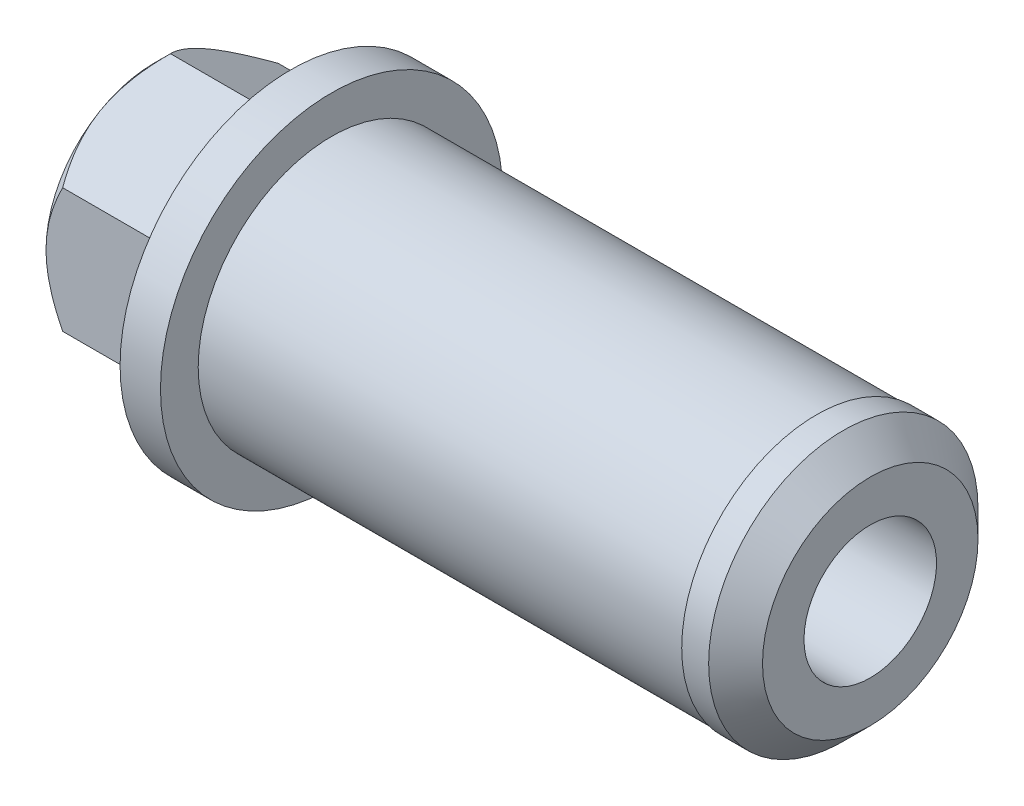
ISO-10303-21;
HEADER;
FILE_DESCRIPTION(('STEP AP214'),'2;1');
FILE_NAME('part.step','',(''),(''),'','','');
FILE_SCHEMA(('AUTOMOTIVE_DESIGN { 1 0 10303 214 1 1 1 1 }'));
ENDSEC;
DATA;
#1=APPLICATION_CONTEXT('core data for automotive mechanical design processes');
#2=APPLICATION_PROTOCOL_DEFINITION('international standard','automotive_design',2000,#1);
#3=PRODUCT_CONTEXT('',#1,'mechanical');
#4=PRODUCT('Part','Part','',(#3));
#5=PRODUCT_RELATED_PRODUCT_CATEGORY('part','',(#4));
#6=PRODUCT_DEFINITION_FORMATION('','',#4);
#7=PRODUCT_DEFINITION_CONTEXT('part definition',#1,'design');
#8=PRODUCT_DEFINITION('design','',#6,#7);
#9=PRODUCT_DEFINITION_SHAPE('','',#8);
#10=(LENGTH_UNIT() NAMED_UNIT(*) SI_UNIT(.MILLI.,.METRE.));
#11=(NAMED_UNIT(*) PLANE_ANGLE_UNIT() SI_UNIT($,.RADIAN.));
#12=(NAMED_UNIT(*) SI_UNIT($,.STERADIAN.) SOLID_ANGLE_UNIT());
#13=UNCERTAINTY_MEASURE_WITH_UNIT(LENGTH_MEASURE(1.E-05),#10,'distance_accuracy_value','');
#14=(GEOMETRIC_REPRESENTATION_CONTEXT(3) GLOBAL_UNCERTAINTY_ASSIGNED_CONTEXT((#13)) GLOBAL_UNIT_ASSIGNED_CONTEXT((#10,
#11,#12)) REPRESENTATION_CONTEXT('',''));
#15=CARTESIAN_POINT('',(0.,0.,0.));
#16=DIRECTION('',(0.,0.,1.));
#17=DIRECTION('',(1.,0.,0.));
#18=AXIS2_PLACEMENT_3D('',#15,#16,#17);
#19=CARTESIAN_POINT('',(-5.1,0.,0.));
#20=DIRECTION('',(-1.,0.,0.));
#21=DIRECTION('',(0.,0.,1.));
#22=AXIS2_PLACEMENT_3D('',#19,#20,#21);
#23=PLANE('',#22);
#24=CARTESIAN_POINT('',(-5.1,0.,0.));
#25=DIRECTION('',(-1.,0.,0.));
#26=DIRECTION('',(0.,0.,1.));
#27=AXIS2_PLACEMENT_3D('',#24,#25,#26);
#28=CIRCLE('',#27,2.96);
#29=CARTESIAN_POINT('',(-5.1,0.,2.96));
#30=VERTEX_POINT('',#29);
#31=EDGE_CURVE('E11',#30,#30,#28,.F.);
#32=ORIENTED_EDGE('',*,*,#31,.T.);
#33=EDGE_LOOP('',(#32));
#34=FACE_BOUND('',#33,.T.);
#35=CARTESIAN_POINT('',(-5.1,0.,0.));
#36=DIRECTION('',(1.,0.,0.));
#37=DIRECTION('',(0.,0.,-1.));
#38=AXIS2_PLACEMENT_3D('',#35,#36,#37);
#39=CIRCLE('',#38,4.);
#40=CARTESIAN_POINT('',(-5.1,0.,4.));
#41=VERTEX_POINT('',#40);
#42=CARTESIAN_POINT('',(-5.1,-3.46410161513775,2.));
#43=VERTEX_POINT('',#42);
#44=EDGE_CURVE('E282',#41,#43,#39,.T.);
#45=ORIENTED_EDGE('',*,*,#44,.F.);
#46=CARTESIAN_POINT('',(-5.1,3.46410161513776,2.));
#47=VERTEX_POINT('',#46);
#48=EDGE_CURVE('E51',#47,#41,#39,.T.);
#49=ORIENTED_EDGE('',*,*,#48,.F.);
#50=CARTESIAN_POINT('',(-5.1,3.46410161513775,-2.));
#51=VERTEX_POINT('',#50);
#52=EDGE_CURVE('E287',#51,#47,#39,.T.);
#53=ORIENTED_EDGE('',*,*,#52,.F.);
#54=CARTESIAN_POINT('',(-5.1,0.,-4.));
#55=VERTEX_POINT('',#54);
#56=EDGE_CURVE('E59',#55,#51,#39,.T.);
#57=ORIENTED_EDGE('',*,*,#56,.F.);
#58=CARTESIAN_POINT('',(-5.1,-3.46410161513776,-2.));
#59=VERTEX_POINT('',#58);
#60=EDGE_CURVE('E288',#59,#55,#39,.T.);
#61=ORIENTED_EDGE('',*,*,#60,.F.);
#62=EDGE_CURVE('E284',#43,#59,#39,.T.);
#63=ORIENTED_EDGE('',*,*,#62,.F.);
#64=EDGE_LOOP('',(#45,#49,#53,#57,#61,#63));
#65=FACE_BOUND('',#64,.T.);
#66=ADVANCED_FACE('F36',(#34,#65),#23,.T.);
#67=CARTESIAN_POINT('',(0.,0.,-2.46));
#68=DIRECTION('',(1.,0.,0.));
#69=DIRECTION('',(0.,0.,-1.));
#70=AXIS2_PLACEMENT_3D('',#67,#68,#69);
#71=PLANE('',#70);
#72=CARTESIAN_POINT('',(0.,0.,0.));
#73=DIRECTION('',(-1.,0.,0.));
#74=DIRECTION('',(0.,0.,1.));
#75=AXIS2_PLACEMENT_3D('',#72,#73,#74);
#76=CIRCLE('',#75,6.35);
#77=CARTESIAN_POINT('',(0.,0.,6.35));
#78=VERTEX_POINT('',#77);
#79=EDGE_CURVE('E159',#78,#78,#76,.T.);
#80=ORIENTED_EDGE('',*,*,#79,.T.);
#81=EDGE_LOOP('',(#80));
#82=FACE_BOUND('',#81,.T.);
#83=DIRECTION('',(0.,0.500000000000001,0.866025403784438));
#84=VECTOR('',#83,1.);
#85=CARTESIAN_POINT('',(0.,-4.61880215351701,0.));
#86=LINE('',#85,#84);
#87=CARTESIAN_POINT('',(0.,-4.61880215351701,0.));
#88=VERTEX_POINT('',#87);
#89=CARTESIAN_POINT('',(0.,-2.3094010767585,4.));
#90=VERTEX_POINT('',#89);
#91=EDGE_CURVE('E303',#88,#90,#86,.T.);
#92=ORIENTED_EDGE('',*,*,#91,.F.);
#93=DIRECTION('',(0.,-0.5,0.866025403784438));
#94=VECTOR('',#93,1.);
#95=CARTESIAN_POINT('',(0.,-2.3094010767585,-4.));
#96=LINE('',#95,#94);
#97=CARTESIAN_POINT('',(0.,-2.3094010767585,-4.));
#98=VERTEX_POINT('',#97);
#99=EDGE_CURVE('E314',#98,#88,#96,.T.);
#100=ORIENTED_EDGE('',*,*,#99,.F.);
#101=DIRECTION('',(0.,-1.,0.));
#102=VECTOR('',#101,1.);
#103=CARTESIAN_POINT('',(0.,2.3094010767585,-4.));
#104=LINE('',#103,#102);
#105=CARTESIAN_POINT('',(0.,2.3094010767585,-4.));
#106=VERTEX_POINT('',#105);
#107=EDGE_CURVE('E312',#106,#98,#104,.T.);
#108=ORIENTED_EDGE('',*,*,#107,.F.);
#109=DIRECTION('',(0.,-0.500000000000001,-0.866025403784438));
#110=VECTOR('',#109,1.);
#111=CARTESIAN_POINT('',(0.,4.61880215351701,0.));
#112=LINE('',#111,#110);
#113=CARTESIAN_POINT('',(0.,4.61880215351701,0.));
#114=VERTEX_POINT('',#113);
#115=EDGE_CURVE('E131',#114,#106,#112,.T.);
#116=ORIENTED_EDGE('',*,*,#115,.F.);
#117=DIRECTION('',(0.,0.5,-0.866025403784439));
#118=VECTOR('',#117,1.);
#119=CARTESIAN_POINT('',(0.,2.30940107675851,4.));
#120=LINE('',#119,#118);
#121=CARTESIAN_POINT('',(0.,2.30940107675851,4.));
#122=VERTEX_POINT('',#121);
#123=EDGE_CURVE('E307',#122,#114,#120,.T.);
#124=ORIENTED_EDGE('',*,*,#123,.F.);
#125=DIRECTION('',(0.,1.,0.));
#126=VECTOR('',#125,1.);
#127=CARTESIAN_POINT('',(0.,-2.3094010767585,4.));
#128=LINE('',#127,#126);
#129=EDGE_CURVE('E305',#90,#122,#128,.T.);
#130=ORIENTED_EDGE('',*,*,#129,.F.);
#131=EDGE_LOOP('',(#92,#100,#108,#116,#124,#130));
#132=FACE_BOUND('',#131,.T.);
#133=ADVANCED_FACE('F262',(#82,#132),#71,.F.);
#134=CARTESIAN_POINT('',(0.,0.,0.));
#135=DIRECTION('',(-1.,0.,0.));
#136=DIRECTION('',(0.,0.,1.));
#137=AXIS2_PLACEMENT_3D('',#134,#135,#136);
#138=CYLINDRICAL_SURFACE('',#137,2.46);
#139=CARTESIAN_POINT('',(-4.6,0.,0.));
#140=DIRECTION('',(-1.,0.,0.));
#141=DIRECTION('',(0.,0.,1.));
#142=AXIS2_PLACEMENT_3D('',#139,#140,#141);
#143=CIRCLE('',#142,2.46);
#144=CARTESIAN_POINT('',(-4.6,0.,2.46));
#145=VERTEX_POINT('',#144);
#146=EDGE_CURVE('E44',#145,#145,#143,.T.);
#147=ORIENTED_EDGE('',*,*,#146,.T.);
#148=EDGE_LOOP('',(#147));
#149=FACE_BOUND('',#148,.T.);
#150=CARTESIAN_POINT('',(21.5,0.,0.));
#151=DIRECTION('',(-1.,0.,0.));
#152=DIRECTION('',(0.,0.,1.));
#153=AXIS2_PLACEMENT_3D('',#150,#151,#152);
#154=CIRCLE('',#153,2.46);
#155=CARTESIAN_POINT('',(21.5,0.,2.46));
#156=VERTEX_POINT('',#155);
#157=EDGE_CURVE('E144',#156,#156,#154,.T.);
#158=ORIENTED_EDGE('',*,*,#157,.F.);
#159=EDGE_LOOP('',(#158));
#160=FACE_BOUND('',#159,.T.);
#161=ADVANCED_FACE('F260',(#149,#160),#138,.F.);
#162=CARTESIAN_POINT('',(0.,0.,0.));
#163=DIRECTION('',(-1.,0.,0.));
#164=DIRECTION('',(0.,0.,1.));
#165=AXIS2_PLACEMENT_3D('',#162,#163,#164);
#166=CYLINDRICAL_SURFACE('',#165,6.35);
#167=ORIENTED_EDGE('',*,*,#79,.F.);
#168=EDGE_LOOP('',(#167));
#169=FACE_BOUND('',#168,.T.);
#170=CARTESIAN_POINT('',(1.5,0.,0.));
#171=DIRECTION('',(-1.,0.,0.));
#172=DIRECTION('',(0.,0.,1.));
#173=AXIS2_PLACEMENT_3D('',#170,#171,#172);
#174=CIRCLE('',#173,6.35);
#175=CARTESIAN_POINT('',(1.5,0.,6.35));
#176=VERTEX_POINT('',#175);
#177=EDGE_CURVE('E156',#176,#176,#174,.T.);
#178=ORIENTED_EDGE('',*,*,#177,.T.);
#179=EDGE_LOOP('',(#178));
#180=FACE_BOUND('',#179,.T.);
#181=ADVANCED_FACE('F256',(#169,#180),#166,.T.);
#182=CARTESIAN_POINT('',(1.5,0.,-6.35));
#183=DIRECTION('',(-1.,0.,0.));
#184=DIRECTION('',(0.,0.,1.));
#185=AXIS2_PLACEMENT_3D('',#182,#183,#184);
#186=PLANE('',#185);
#187=ORIENTED_EDGE('',*,*,#177,.F.);
#188=EDGE_LOOP('',(#187));
#189=FACE_BOUND('',#188,.T.);
#190=CARTESIAN_POINT('',(1.5,0.,0.));
#191=DIRECTION('',(-1.,0.,0.));
#192=DIRECTION('',(0.,0.,1.));
#193=AXIS2_PLACEMENT_3D('',#190,#191,#192);
#194=CIRCLE('',#193,4.95);
#195=CARTESIAN_POINT('',(1.5,0.,4.95));
#196=VERTEX_POINT('',#195);
#197=EDGE_CURVE('E153',#196,#196,#194,.T.);
#198=ORIENTED_EDGE('',*,*,#197,.T.);
#199=EDGE_LOOP('',(#198));
#200=FACE_BOUND('',#199,.T.);
#201=ADVANCED_FACE('F252',(#189,#200),#186,.F.);
#202=CARTESIAN_POINT('',(0.,0.,0.));
#203=DIRECTION('',(-1.,0.,0.));
#204=DIRECTION('',(0.,0.,1.));
#205=AXIS2_PLACEMENT_3D('',#202,#203,#204);
#206=CYLINDRICAL_SURFACE('',#205,4.95);
#207=ORIENTED_EDGE('',*,*,#197,.F.);
#208=EDGE_LOOP('',(#207));
#209=FACE_BOUND('',#208,.T.);
#210=CARTESIAN_POINT('',(19.5,0.,0.));
#211=DIRECTION('',(-1.,0.,0.));
#212=DIRECTION('',(0.,0.,1.));
#213=AXIS2_PLACEMENT_3D('',#210,#211,#212);
#214=CIRCLE('',#213,4.95);
#215=CARTESIAN_POINT('',(19.5,0.,4.95));
#216=VERTEX_POINT('',#215);
#217=EDGE_CURVE('E150',#216,#216,#214,.T.);
#218=ORIENTED_EDGE('',*,*,#217,.T.);
#219=EDGE_LOOP('',(#218));
#220=FACE_BOUND('',#219,.T.);
#221=ADVANCED_FACE('F248',(#209,#220),#206,.T.);
#222=CARTESIAN_POINT('',(19.5,0.,-4.95));
#223=DIRECTION('',(1.,0.,0.));
#224=DIRECTION('',(0.,0.,-1.));
#225=AXIS2_PLACEMENT_3D('',#222,#223,#224);
#226=PLANE('',#225);
#227=ORIENTED_EDGE('',*,*,#217,.F.);
#228=EDGE_LOOP('',(#227));
#229=FACE_BOUND('',#228,.T.);
#230=CARTESIAN_POINT('',(19.5,0.,0.));
#231=DIRECTION('',(-1.,0.,0.));
#232=DIRECTION('',(0.,0.,1.));
#233=AXIS2_PLACEMENT_3D('',#230,#231,#232);
#234=CIRCLE('',#233,5.);
#235=CARTESIAN_POINT('',(19.5,0.,5.));
#236=VERTEX_POINT('',#235);
#237=EDGE_CURVE('E147',#236,#236,#234,.T.);
#238=ORIENTED_EDGE('',*,*,#237,.T.);
#239=EDGE_LOOP('',(#238));
#240=FACE_BOUND('',#239,.T.);
#241=ADVANCED_FACE('F244',(#229,#240),#226,.F.);
#242=CARTESIAN_POINT('',(0.,0.,0.));
#243=DIRECTION('',(-1.,0.,0.));
#244=DIRECTION('',(0.,0.,1.));
#245=AXIS2_PLACEMENT_3D('',#242,#243,#244);
#246=CYLINDRICAL_SURFACE('',#245,5.);
#247=CARTESIAN_POINT('',(20.5,0.,0.));
#248=DIRECTION('',(-1.,0.,0.));
#249=DIRECTION('',(0.,0.,1.));
#250=AXIS2_PLACEMENT_3D('',#247,#248,#249);
#251=CIRCLE('',#250,5.);
#252=CARTESIAN_POINT('',(20.5,0.,5.));
#253=VERTEX_POINT('',#252);
#254=EDGE_CURVE('E162',#253,#253,#251,.T.);
#255=ORIENTED_EDGE('',*,*,#254,.T.);
#256=EDGE_LOOP('',(#255));
#257=FACE_BOUND('',#256,.T.);
#258=ORIENTED_EDGE('',*,*,#237,.F.);
#259=EDGE_LOOP('',(#258));
#260=FACE_BOUND('',#259,.T.);
#261=ADVANCED_FACE('F240',(#257,#260),#246,.T.);
#262=CARTESIAN_POINT('',(21.5,0.,-5.));
#263=DIRECTION('',(-1.,0.,0.));
#264=DIRECTION('',(0.,0.,1.));
#265=AXIS2_PLACEMENT_3D('',#262,#263,#264);
#266=PLANE('',#265);
#267=CARTESIAN_POINT('',(21.5,0.,0.));
#268=DIRECTION('',(-1.,0.,0.));
#269=DIRECTION('',(0.,0.,1.));
#270=AXIS2_PLACEMENT_3D('',#267,#268,#269);
#271=CIRCLE('',#270,4.);
#272=CARTESIAN_POINT('',(21.5,0.,4.));
#273=VERTEX_POINT('',#272);
#274=EDGE_CURVE('E165',#273,#273,#271,.F.);
#275=ORIENTED_EDGE('',*,*,#274,.T.);
#276=EDGE_LOOP('',(#275));
#277=FACE_BOUND('',#276,.T.);
#278=ORIENTED_EDGE('',*,*,#157,.T.);
#279=EDGE_LOOP('',(#278));
#280=FACE_BOUND('',#279,.T.);
#281=ADVANCED_FACE('F237',(#277,#280),#266,.F.);
#282=CARTESIAN_POINT('',(20.5,0.,0.));
#283=DIRECTION('',(-1.,0.,0.));
#284=DIRECTION('',(0.,0.,1.));
#285=AXIS2_PLACEMENT_3D('',#282,#283,#284);
#286=CONICAL_SURFACE('',#285,5.,0.78539816339745);
#287=ORIENTED_EDGE('',*,*,#274,.F.);
#288=EDGE_LOOP('',(#287));
#289=FACE_BOUND('',#288,.T.);
#290=ORIENTED_EDGE('',*,*,#254,.F.);
#291=EDGE_LOOP('',(#290));
#292=FACE_BOUND('',#291,.T.);
#293=ADVANCED_FACE('F235',(#289,#292),#286,.T.);
#294=CARTESIAN_POINT('',(-5.1,-4.61880215351701,0.));
#295=DIRECTION('',(0.,0.866025403784438,-0.500000000000001));
#296=DIRECTION('',(0.,0.500000000000001,0.866025403784438));
#297=AXIS2_PLACEMENT_3D('',#294,#295,#296);
#298=PLANE('',#297);
#299=DIRECTION('',(1.,0.,0.));
#300=VECTOR('',#299,1.);
#301=CARTESIAN_POINT('',(-5.1,-2.3094010767585,4.));
#302=LINE('',#301,#300);
#303=CARTESIAN_POINT('',(-4.48119784648299,-2.3094010767585,4.));
#304=VERTEX_POINT('',#303);
#305=EDGE_CURVE('E142',#304,#90,#302,.T.);
#306=ORIENTED_EDGE('',*,*,#305,.F.);
#307=CARTESIAN_POINT('',(-4.48108237209913,-2.30928560670466,4.0002));
#308=CARTESIAN_POINT('',(-4.52078899052543,-2.34899632674695,3.93141901528162));
#309=CARTESIAN_POINT('',(-4.55927742936984,-2.3890109267086,3.8621116951035));
#310=CARTESIAN_POINT('',(-4.63344662274748,-2.46971048312824,3.72233596323641));
#311=CARTESIAN_POINT('',(-4.66912584375135,-2.51039579126537,3.6518669424213));
#312=CARTESIAN_POINT('',(-4.771696978832,-2.63392971018402,3.4378999183961));
#313=CARTESIAN_POINT('',(-4.83368473547043,-2.71782823500144,3.29258341073226));
#314=CARTESIAN_POINT('',(-4.93984197747359,-2.88698352725106,2.99959785018676));
#315=CARTESIAN_POINT('',(-4.98427879102956,-2.97219756726617,2.85200280336237));
#316=CARTESIAN_POINT('',(-5.05274886435355,-3.14450730387842,2.55355358491115));
#317=CARTESIAN_POINT('',(-5.07683320862169,-3.2315977233138,2.40270855359658));
#318=CARTESIAN_POINT('',(-5.09856296562247,-3.38169462438279,2.14273309488646));
#319=CARTESIAN_POINT('',(-5.10177893184214,-3.44450772236845,2.03393761779449));
#320=CARTESIAN_POINT('',(-5.096357788258,-3.57003196860171,1.8165232457367));
#321=CARTESIAN_POINT('',(-5.08771652331117,-3.63274307339631,1.70790442603367));
#322=CARTESIAN_POINT('',(-5.05907380798657,-3.75757108217469,1.49169597262187));
#323=CARTESIAN_POINT('',(-5.03905965193174,-3.81968724243513,1.3841076270797));
#324=CARTESIAN_POINT('',(-4.98876368911835,-3.94285275199685,1.17077870677869));
#325=CARTESIAN_POINT('',(-4.95848266960464,-4.00390218271575,1.06503799100039));
#326=CARTESIAN_POINT('',(-4.89618259378878,-4.11227961083265,0.877322779108272));
#327=CARTESIAN_POINT('',(-4.8658015666229,-4.15984755582568,0.79493268156872));
#328=CARTESIAN_POINT('',(-4.80014338192266,-4.25412951504788,0.631631537958729));
#329=CARTESIAN_POINT('',(-4.76486607544322,-4.30084350325071,0.550720536967258));
#330=CARTESIAN_POINT('',(-4.69020615946207,-4.39327037218423,0.390632503989882));
#331=CARTESIAN_POINT('',(-4.6508364594794,-4.43898588170052,0.311450918813774));
#332=CARTESIAN_POINT('',(-4.5685087383397,-4.52957030284816,0.154554099011851));
#333=CARTESIAN_POINT('',(-4.52555291868104,-4.57443971345263,0.0768380001392379));
#334=CARTESIAN_POINT('',(-4.48108237209913,-4.61891762357085,-0.000200000000000058));
#335=B_SPLINE_CURVE_WITH_KNOTS('',3,(#307,#308,#309,#310,#311,#312,#313,#314,#315,#316,#317,
#318,#319,#320,#321,#322,#323,#324,#325,#326,#327,#328,#329,#330,#331,#332,#333,#334),
.UNSPECIFIED.,.F.,.F.,(4,2,2,2,2,2,2,2,2,2,2,2,2,4),(0.,0.266361961703662,0.532868334400107,
1.06875865685461,1.59613884594049,2.12219135055578,2.49866160599655,2.87526382203491,
3.25228760372073,3.62928248242853,3.92874944437158,4.22822551811343,4.52678401907573,
4.82516056577922),.UNSPECIFIED.);
#336=EDGE_CURVE('E126',#304,#43,#335,.T.);
#337=ORIENTED_EDGE('',*,*,#336,.T.);
#338=CARTESIAN_POINT('',(-4.48119784648299,-4.61880215351701,0.));
#339=VERTEX_POINT('',#338);
#340=EDGE_CURVE('E199',#43,#339,#335,.T.);
#341=ORIENTED_EDGE('',*,*,#340,.T.);
#342=DIRECTION('',(1.,0.,0.));
#343=VECTOR('',#342,1.);
#344=CARTESIAN_POINT('',(-5.1,-4.61880215351701,0.));
#345=LINE('',#344,#343);
#346=EDGE_CURVE('E137',#339,#88,#345,.T.);
#347=ORIENTED_EDGE('',*,*,#346,.T.);
#348=ORIENTED_EDGE('',*,*,#91,.T.);
#349=EDGE_LOOP('',(#306,#337,#341,#347,#348));
#350=FACE_BOUND('',#349,.T.);
#351=ADVANCED_FACE('F229',(#350),#298,.F.);
#352=CARTESIAN_POINT('',(-5.1,-2.3094010767585,4.));
#353=DIRECTION('',(0.,0.,-1.));
#354=DIRECTION('',(0.,1.,0.));
#355=AXIS2_PLACEMENT_3D('',#352,#353,#354);
#356=PLANE('',#355);
#357=DIRECTION('',(1.,0.,0.));
#358=VECTOR('',#357,1.);
#359=CARTESIAN_POINT('',(-5.1,2.30940107675851,4.));
#360=LINE('',#359,#358);
#361=CARTESIAN_POINT('',(-4.48119784648299,2.30940107675851,4.));
#362=VERTEX_POINT('',#361);
#363=EDGE_CURVE('E135',#362,#122,#360,.T.);
#364=ORIENTED_EDGE('',*,*,#363,.F.);
#365=CARTESIAN_POINT('',(-2.83678461128598,-4.81952974940749,4.));
#366=CARTESIAN_POINT('',(-2.92636294215643,-4.70309216754233,4.));
#367=CARTESIAN_POINT('',(-3.0151385844768,-4.58602719829636,4.));
#368=CARTESIAN_POINT('',(-3.19071777282994,-4.3503860512202,4.));
#369=CARTESIAN_POINT('',(-3.27752084732042,-4.2318095224096,4.));
#370=CARTESIAN_POINT('',(-3.44940591008956,-3.99202229936412,4.));
#371=CARTESIAN_POINT('',(-3.53446945415143,-3.870798340518,4.));
#372=CARTESIAN_POINT('',(-3.70163630821028,-3.62633290119854,4.));
#373=CARTESIAN_POINT('',(-3.78373982203724,-3.50309156049674,4.));
#374=CARTESIAN_POINT('',(-3.9494032576463,-3.24636255832609,4.));
#375=CARTESIAN_POINT('',(-4.03272542085204,-3.11272070106124,4.));
#376=CARTESIAN_POINT('',(-4.19419807093999,-2.84229861383361,4.));
#377=CARTESIAN_POINT('',(-4.27234768747635,-2.70551786090031,4.));
#378=CARTESIAN_POINT('',(-4.42181093937827,-2.42878056467515,4.));
#379=CARTESIAN_POINT('',(-4.49314464180467,-2.28883494483992,4.));
#380=CARTESIAN_POINT('',(-4.62737784917563,-2.00498757663521,4.));
#381=CARTESIAN_POINT('',(-4.69028133290693,-1.86108773344898,4.));
#382=CARTESIAN_POINT('',(-4.79969473675121,-1.58342893734174,4.));
#383=CARTESIAN_POINT('',(-4.84720974257752,-1.45007011340975,4.));
#384=CARTESIAN_POINT('',(-4.93156519966147,-1.17995488398092,4.));
#385=CARTESIAN_POINT('',(-4.9684049710111,-1.04319826267965,4.));
#386=CARTESIAN_POINT('',(-5.02880179499581,-0.769486022613106,4.));
#387=CARTESIAN_POINT('',(-5.05260009552649,-0.632584546895031,4.));
#388=CARTESIAN_POINT('',(-5.08641750108615,-0.357080709123292,4.));
#389=CARTESIAN_POINT('',(-5.0964394649071,-0.218478705978884,4.));
#390=CARTESIAN_POINT('',(-5.10185050690913,0.0529507020266497,4.));
#391=CARTESIAN_POINT('',(-5.09785970827475,0.185765859834694,4.));
#392=CARTESIAN_POINT('',(-5.07688915629962,0.450359747774035,4.));
#393=CARTESIAN_POINT('',(-5.05990822315386,0.58213838266669,4.));
#394=CARTESIAN_POINT('',(-5.01362892534461,0.845938834838876,4.));
#395=CARTESIAN_POINT('',(-4.98411309442168,0.977921849267815,4.));
#396=CARTESIAN_POINT('',(-4.91440150126756,1.23898137971302,4.));
#397=CARTESIAN_POINT('',(-4.87420634560922,1.36805806035403,4.));
#398=CARTESIAN_POINT('',(-4.78232848947368,1.63041586420204,4.));
#399=CARTESIAN_POINT('',(-4.7301165772418,1.76350953495664,4.));
#400=CARTESIAN_POINT('',(-4.61762635793245,2.02627346027599,4.));
#401=CARTESIAN_POINT('',(-4.55734441370411,2.15594213946629,4.));
#402=CARTESIAN_POINT('',(-4.43014370377874,2.41246844986754,4.));
#403=CARTESIAN_POINT('',(-4.3632044965674,2.5393158620577,4.));
#404=CARTESIAN_POINT('',(-4.22416233280143,2.79010403830294,4.));
#405=CARTESIAN_POINT('',(-4.15206017130905,2.91404524600961,4.));
#406=CARTESIAN_POINT('',(-4.00736310939975,3.15334336234392,4.));
#407=CARTESIAN_POINT('',(-3.93496836401797,3.26882194216559,4.));
#408=CARTESIAN_POINT('',(-3.78709738827001,3.49779509299912,4.));
#409=CARTESIAN_POINT('',(-3.71162092687163,3.61128951434694,4.));
#410=CARTESIAN_POINT('',(-3.55875050944935,3.8356414491525,4.));
#411=CARTESIAN_POINT('',(-3.48137681420984,3.94651281785068,4.));
#412=CARTESIAN_POINT('',(-3.32455530734092,4.16673455070892,4.));
#413=CARTESIAN_POINT('',(-3.24510807335263,4.27608532573151,4.));
#414=CARTESIAN_POINT('',(-3.16481208632949,4.38479823601728,4.));
#415=B_SPLINE_CURVE_WITH_KNOTS('',3,(#365,#366,#367,#368,#369,#370,#371,#372,#373,#374,#375,
#376,#377,#378,#379,#380,#381,#382,#383,#384,#385,#386,#387,#388,#389,#390,#391,#392,#393,#394,
#395,#396,#397,#398,#399,#400,#401,#402,#403,#404,#405,#406,#407,#408,#409,#410,#411,#412,#413,
#414),.UNSPECIFIED.,.F.,.F.,(4,2,2,2,2,2,2,2,2,2,2,2,2,2,2,2,2,2,2,2,2,2,2,2,4),(0.,
0.440732365063031,0.881569001863996,1.32580660852613,1.77001356598453,2.24238695696789,
2.71483962969296,3.18585545909472,3.65664819565422,4.08099413126666,4.50536708762677,
4.9215992232885,5.33774497163005,5.73571105165653,6.13371328051046,6.53892220218653,
6.94410811339989,7.37268518912191,7.80145607828324,8.23158675780794,8.66165134179226,
9.07047872649948,9.47933681693734,9.8849122325451,10.2903758451868),.UNSPECIFIED.);
#416=EDGE_CURVE('E217',#362,#41,#415,.F.);
#417=ORIENTED_EDGE('',*,*,#416,.T.);
#418=EDGE_CURVE('E116',#41,#304,#415,.F.);
#419=ORIENTED_EDGE('',*,*,#418,.T.);
#420=ORIENTED_EDGE('',*,*,#305,.T.);
#421=ORIENTED_EDGE('',*,*,#129,.T.);
#422=EDGE_LOOP('',(#364,#417,#419,#420,#421));
#423=FACE_BOUND('',#422,.T.);
#424=ADVANCED_FACE('F225',(#423),#356,.F.);
#425=CARTESIAN_POINT('',(-5.1,2.30940107675851,4.));
#426=DIRECTION('',(0.,-0.866025403784439,-0.5));
#427=DIRECTION('',(0.,0.5,-0.866025403784439));
#428=AXIS2_PLACEMENT_3D('',#425,#426,#427);
#429=PLANE('',#428);
#430=DIRECTION('',(1.,0.,0.));
#431=VECTOR('',#430,1.);
#432=CARTESIAN_POINT('',(-5.1,4.61880215351701,0.));
#433=LINE('',#432,#431);
#434=CARTESIAN_POINT('',(-4.48119784648299,4.61880215351701,0.));
#435=VERTEX_POINT('',#434);
#436=EDGE_CURVE('E132',#435,#114,#433,.T.);
#437=ORIENTED_EDGE('',*,*,#436,.F.);
#438=CARTESIAN_POINT('',(-4.48108237209913,4.61891762357085,-0.0002));
#439=CARTESIAN_POINT('',(-4.52078899052543,4.57920690352856,0.0685809847183836));
#440=CARTESIAN_POINT('',(-4.55927742936984,4.53919230356691,0.137888304896501));
#441=CARTESIAN_POINT('',(-4.63344662274748,4.45849274714727,0.277664036763592));
#442=CARTESIAN_POINT('',(-4.66912584375135,4.41780743901014,0.348133057578702));
#443=CARTESIAN_POINT('',(-4.771696978832,4.29427352009149,0.562100081603898));
#444=CARTESIAN_POINT('',(-4.83368473547043,4.21037499527407,0.707416589267739));
#445=CARTESIAN_POINT('',(-4.93984197747359,4.04121970302445,1.00040214981325));
#446=CARTESIAN_POINT('',(-4.98427879102955,3.95600566300933,1.14799719663763));
#447=CARTESIAN_POINT('',(-5.05274886435354,3.78369592639709,1.44644641508886));
#448=CARTESIAN_POINT('',(-5.07683320862169,3.6966055069617,1.59729144640342));
#449=CARTESIAN_POINT('',(-5.09856296562246,3.54650860589272,1.85726690511354));
#450=CARTESIAN_POINT('',(-5.10177893184214,3.48369550790706,1.96606238220551));
#451=CARTESIAN_POINT('',(-5.09635778825799,3.3581712616738,2.18347675426331));
#452=CARTESIAN_POINT('',(-5.08771652331117,3.2954601568792,2.29209557396633));
#453=CARTESIAN_POINT('',(-5.05907380798657,3.17063214810082,2.50830402737813));
#454=CARTESIAN_POINT('',(-5.03905965193174,3.10851598784038,2.61589237292031));
#455=CARTESIAN_POINT('',(-4.98876368911835,2.98535047827866,2.82922129322132));
#456=CARTESIAN_POINT('',(-4.95848266960463,2.92430104755976,2.93496200899961));
#457=CARTESIAN_POINT('',(-4.89618259378878,2.81592361944286,3.12267722089173));
#458=CARTESIAN_POINT('',(-4.8658015666229,2.76835567444984,3.20506731843128));
#459=CARTESIAN_POINT('',(-4.80014338192266,2.67407371522763,3.36836846204127));
#460=CARTESIAN_POINT('',(-4.76486607544322,2.62735972702481,3.44927946303274));
#461=CARTESIAN_POINT('',(-4.69020615946207,2.53493285809128,3.60936749601012));
#462=CARTESIAN_POINT('',(-4.65083645947939,2.48921734857499,3.68854908118623));
#463=CARTESIAN_POINT('',(-4.56850873833969,2.39863292742736,3.84544590098815));
#464=CARTESIAN_POINT('',(-4.52555291868104,2.35376351682289,3.92316199986076));
#465=CARTESIAN_POINT('',(-4.48108237209913,2.30928560670467,4.0002));
#466=B_SPLINE_CURVE_WITH_KNOTS('',3,(#438,#439,#440,#441,#442,#443,#444,#445,#446,#447,#448,
#449,#450,#451,#452,#453,#454,#455,#456,#457,#458,#459,#460,#461,#462,#463,#464,#465),
.UNSPECIFIED.,.F.,.F.,(4,2,2,2,2,2,2,2,2,2,2,2,2,4),(0.,0.266361961703662,0.532868334400108,
1.06875865685461,1.59613884594049,2.12219135055579,2.49866160599656,2.87526382203491,
3.25228760372073,3.62928248242854,3.92874944437158,4.22822551811343,4.52678401907573,
4.82516056577922),.UNSPECIFIED.);
#467=EDGE_CURVE('E293',#435,#47,#466,.T.);
#468=ORIENTED_EDGE('',*,*,#467,.T.);
#469=EDGE_CURVE('E218',#47,#362,#466,.T.);
#470=ORIENTED_EDGE('',*,*,#469,.T.);
#471=ORIENTED_EDGE('',*,*,#363,.T.);
#472=ORIENTED_EDGE('',*,*,#123,.T.);
#473=EDGE_LOOP('',(#437,#468,#470,#471,#472));
#474=FACE_BOUND('',#473,.T.);
#475=ADVANCED_FACE('F228',(#474),#429,.F.);
#476=CARTESIAN_POINT('',(-5.1,4.61880215351701,0.));
#477=DIRECTION('',(0.,-0.866025403784438,0.500000000000001));
#478=DIRECTION('',(0.,-0.500000000000001,-0.866025403784438));
#479=AXIS2_PLACEMENT_3D('',#476,#477,#478);
#480=PLANE('',#479);
#481=DIRECTION('',(1.,0.,0.));
#482=VECTOR('',#481,1.);
#483=CARTESIAN_POINT('',(-5.1,2.3094010767585,-4.));
#484=LINE('',#483,#482);
#485=CARTESIAN_POINT('',(-4.48119784648299,2.30940107675851,-4.));
#486=VERTEX_POINT('',#485);
#487=EDGE_CURVE('E123',#486,#106,#484,.T.);
#488=ORIENTED_EDGE('',*,*,#487,.F.);
#489=CARTESIAN_POINT('',(-4.48108237209913,2.30928560670466,-4.0002));
#490=CARTESIAN_POINT('',(-4.52078899052543,2.34899632674695,-3.93141901528162));
#491=CARTESIAN_POINT('',(-4.55927742936984,2.3890109267086,-3.8621116951035));
#492=CARTESIAN_POINT('',(-4.63344662274748,2.46971048312824,-3.72233596323641));
#493=CARTESIAN_POINT('',(-4.66912584375135,2.51039579126537,-3.6518669424213));
#494=CARTESIAN_POINT('',(-4.771696978832,2.63392971018402,-3.4378999183961));
#495=CARTESIAN_POINT('',(-4.83368473547043,2.71782823500144,-3.29258341073226));
#496=CARTESIAN_POINT('',(-4.93984197747359,2.88698352725106,-2.99959785018676));
#497=CARTESIAN_POINT('',(-4.98427879102956,2.97219756726618,-2.85200280336237));
#498=CARTESIAN_POINT('',(-5.05274886435355,3.14450730387842,-2.55355358491115));
#499=CARTESIAN_POINT('',(-5.07683320862169,3.2315977233138,-2.40270855359658));
#500=CARTESIAN_POINT('',(-5.09856296562246,3.38169462438279,-2.14273309488646));
#501=CARTESIAN_POINT('',(-5.10177893184214,3.44450772236845,-2.03393761779449));
#502=CARTESIAN_POINT('',(-5.096357788258,3.57003196860171,-1.8165232457367));
#503=CARTESIAN_POINT('',(-5.08771652331117,3.63274307339631,-1.70790442603367));
#504=CARTESIAN_POINT('',(-5.05907380798657,3.75757108217469,-1.49169597262187));
#505=CARTESIAN_POINT('',(-5.03905965193174,3.81968724243513,-1.3841076270797));
#506=CARTESIAN_POINT('',(-4.98876368911835,3.94285275199685,-1.17077870677869));
#507=CARTESIAN_POINT('',(-4.95848266960464,4.00390218271575,-1.06503799100039));
#508=CARTESIAN_POINT('',(-4.89618259378878,4.11227961083265,-0.877322779108274));
#509=CARTESIAN_POINT('',(-4.8658015666229,4.15984755582568,-0.794932681568721));
#510=CARTESIAN_POINT('',(-4.80014338192266,4.25412951504788,-0.631631537958731));
#511=CARTESIAN_POINT('',(-4.76486607544322,4.30084350325071,-0.55072053696726));
#512=CARTESIAN_POINT('',(-4.69020615946207,4.39327037218423,-0.390632503989882));
#513=CARTESIAN_POINT('',(-4.6508364594794,4.43898588170052,-0.311450918813774));
#514=CARTESIAN_POINT('',(-4.5685087383397,4.52957030284816,-0.154554099011851));
#515=CARTESIAN_POINT('',(-4.52555291868104,4.57443971345263,-0.0768380001392378));
#516=CARTESIAN_POINT('',(-4.48108237209913,4.61891762357085,0.000200000000000015));
#517=B_SPLINE_CURVE_WITH_KNOTS('',3,(#489,#490,#491,#492,#493,#494,#495,#496,#497,#498,#499,
#500,#501,#502,#503,#504,#505,#506,#507,#508,#509,#510,#511,#512,#513,#514,#515,#516),
.UNSPECIFIED.,.F.,.F.,(4,2,2,2,2,2,2,2,2,2,2,2,2,4),(0.,0.266361961703661,0.532868334400106,
1.06875865685461,1.59613884594049,2.12219135055578,2.49866160599655,2.87526382203491,
3.25228760372072,3.62928248242853,3.92874944437157,4.22822551811343,4.52678401907573,
4.82516056577922),.UNSPECIFIED.);
#518=EDGE_CURVE('E107',#486,#51,#517,.T.);
#519=ORIENTED_EDGE('',*,*,#518,.T.);
#520=EDGE_CURVE('E118',#51,#435,#517,.T.);
#521=ORIENTED_EDGE('',*,*,#520,.T.);
#522=ORIENTED_EDGE('',*,*,#436,.T.);
#523=ORIENTED_EDGE('',*,*,#115,.T.);
#524=EDGE_LOOP('',(#488,#519,#521,#522,#523));
#525=FACE_BOUND('',#524,.T.);
#526=ADVANCED_FACE('F129',(#525),#480,.F.);
#527=CARTESIAN_POINT('',(-5.1,2.3094010767585,-4.));
#528=DIRECTION('',(0.,0.,1.));
#529=DIRECTION('',(0.,-1.,0.));
#530=AXIS2_PLACEMENT_3D('',#527,#528,#529);
#531=PLANE('',#530);
#532=DIRECTION('',(1.,0.,0.));
#533=VECTOR('',#532,1.);
#534=CARTESIAN_POINT('',(-5.1,-2.3094010767585,-4.));
#535=LINE('',#534,#533);
#536=CARTESIAN_POINT('',(-4.48119784648299,-2.3094010767585,-4.));
#537=VERTEX_POINT('',#536);
#538=EDGE_CURVE('E133',#537,#98,#535,.T.);
#539=ORIENTED_EDGE('',*,*,#538,.F.);
#540=CARTESIAN_POINT('',(-2.83678461128597,-4.81952974940751,-4.));
#541=CARTESIAN_POINT('',(-2.92636294215643,-4.70309216754234,-4.));
#542=CARTESIAN_POINT('',(-3.0151385844768,-4.58602719829638,-4.));
#543=CARTESIAN_POINT('',(-3.19071777282993,-4.35038605122022,-4.));
#544=CARTESIAN_POINT('',(-3.27752084732041,-4.23180952240962,-4.));
#545=CARTESIAN_POINT('',(-3.44940591008955,-3.99202229936413,-4.));
#546=CARTESIAN_POINT('',(-3.53446945415142,-3.87079834051801,-4.));
#547=CARTESIAN_POINT('',(-3.70163630821027,-3.62633290119855,-4.));
#548=CARTESIAN_POINT('',(-3.78373982203724,-3.50309156049675,-4.));
#549=CARTESIAN_POINT('',(-3.9494032576463,-3.2463625583261,-4.));
#550=CARTESIAN_POINT('',(-4.03272542085203,-3.11272070106125,-4.));
#551=CARTESIAN_POINT('',(-4.19419807093999,-2.84229861383362,-4.));
#552=CARTESIAN_POINT('',(-4.27234768747635,-2.70551786090031,-4.));
#553=CARTESIAN_POINT('',(-4.42181093937827,-2.42878056467516,-4.));
#554=CARTESIAN_POINT('',(-4.49314464180467,-2.28883494483992,-4.));
#555=CARTESIAN_POINT('',(-4.62737784917563,-2.00498757663521,-4.));
#556=CARTESIAN_POINT('',(-4.69028133290693,-1.86108773344899,-4.));
#557=CARTESIAN_POINT('',(-4.79969473675121,-1.58342893734174,-4.));
#558=CARTESIAN_POINT('',(-4.84720974257752,-1.45007011340975,-4.));
#559=CARTESIAN_POINT('',(-4.93156519966147,-1.17995488398093,-4.));
#560=CARTESIAN_POINT('',(-4.9684049710111,-1.04319826267965,-4.));
#561=CARTESIAN_POINT('',(-5.02880179499581,-0.769486022613108,-4.));
#562=CARTESIAN_POINT('',(-5.05260009552649,-0.632584546895033,-4.));
#563=CARTESIAN_POINT('',(-5.08641750108615,-0.357080709123294,-4.));
#564=CARTESIAN_POINT('',(-5.09643946490711,-0.218478705978886,-4.));
#565=CARTESIAN_POINT('',(-5.10185050690914,0.0529507020266475,-4.));
#566=CARTESIAN_POINT('',(-5.09785970827475,0.185765859834692,-4.));
#567=CARTESIAN_POINT('',(-5.07688915629962,0.450359747774033,-4.));
#568=CARTESIAN_POINT('',(-5.05990822315386,0.582138382666688,-4.));
#569=CARTESIAN_POINT('',(-5.01362892534461,0.845938834838875,-4.));
#570=CARTESIAN_POINT('',(-4.98411309442169,0.977921849267814,-4.));
#571=CARTESIAN_POINT('',(-4.91440150126757,1.23898137971302,-4.));
#572=CARTESIAN_POINT('',(-4.87420634560922,1.36805806035403,-4.));
#573=CARTESIAN_POINT('',(-4.78232848947368,1.63041586420203,-4.));
#574=CARTESIAN_POINT('',(-4.7301165772418,1.76350953495664,-4.));
#575=CARTESIAN_POINT('',(-4.61762635793246,2.02627346027599,-4.));
#576=CARTESIAN_POINT('',(-4.55734441370411,2.15594213946629,-4.));
#577=CARTESIAN_POINT('',(-4.43014370377874,2.41246844986754,-4.));
#578=CARTESIAN_POINT('',(-4.36320449656741,2.53931586205769,-4.));
#579=CARTESIAN_POINT('',(-4.22416233280143,2.79010403830294,-4.));
#580=CARTESIAN_POINT('',(-4.15206017130906,2.91404524600961,-4.));
#581=CARTESIAN_POINT('',(-4.00736310939976,3.15334336234391,-4.));
#582=CARTESIAN_POINT('',(-3.93496836401797,3.26882194216558,-4.));
#583=CARTESIAN_POINT('',(-3.78709738827001,3.49779509299911,-4.));
#584=CARTESIAN_POINT('',(-3.71162092687163,3.61128951434693,-4.));
#585=CARTESIAN_POINT('',(-3.55875050944936,3.83564144915249,-4.));
#586=CARTESIAN_POINT('',(-3.48137681420984,3.94651281785067,-4.));
#587=CARTESIAN_POINT('',(-3.32455530734092,4.16673455070891,-4.));
#588=CARTESIAN_POINT('',(-3.24510807335263,4.2760853257315,-4.));
#589=CARTESIAN_POINT('',(-3.16481208632949,4.38479823601728,-4.));
#590=B_SPLINE_CURVE_WITH_KNOTS('',3,(#540,#541,#542,#543,#544,#545,#546,#547,#548,#549,#550,
#551,#552,#553,#554,#555,#556,#557,#558,#559,#560,#561,#562,#563,#564,#565,#566,#567,#568,#569,
#570,#571,#572,#573,#574,#575,#576,#577,#578,#579,#580,#581,#582,#583,#584,#585,#586,#587,#588,
#589),.UNSPECIFIED.,.F.,.F.,(4,2,2,2,2,2,2,2,2,2,2,2,2,2,2,2,2,2,2,2,2,2,2,2,4),(0.,
0.44073236506303,0.881569001863997,1.32580660852613,1.77001356598453,2.24238695696789,
2.71483962969297,3.18585545909473,3.65664819565424,4.08099413126667,4.50536708762678,
4.92159922328851,5.33774497163006,5.73571105165654,6.13371328051048,6.53892220218655,
6.9441081133999,7.37268518912192,7.80145607828325,8.23158675780796,8.66165134179227,
9.07047872649949,9.47933681693735,9.88491223254511,10.2903758451868),.UNSPECIFIED.);
#591=EDGE_CURVE('E125',#537,#55,#590,.T.);
#592=ORIENTED_EDGE('',*,*,#591,.T.);
#593=EDGE_CURVE('E110',#55,#486,#590,.T.);
#594=ORIENTED_EDGE('',*,*,#593,.T.);
#595=ORIENTED_EDGE('',*,*,#487,.T.);
#596=ORIENTED_EDGE('',*,*,#107,.T.);
#597=EDGE_LOOP('',(#539,#592,#594,#595,#596));
#598=FACE_BOUND('',#597,.T.);
#599=ADVANCED_FACE('F121',(#598),#531,.F.);
#600=CARTESIAN_POINT('',(-5.1,-2.3094010767585,-4.));
#601=DIRECTION('',(0.,0.866025403784439,0.5));
#602=DIRECTION('',(0.,-0.5,0.866025403784439));
#603=AXIS2_PLACEMENT_3D('',#600,#601,#602);
#604=PLANE('',#603);
#605=ORIENTED_EDGE('',*,*,#346,.F.);
#606=CARTESIAN_POINT('',(-4.48108237209913,-4.61891762357085,0.000200000000000118));
#607=CARTESIAN_POINT('',(-4.52078899052543,-4.57920690352856,-0.0685809847183828));
#608=CARTESIAN_POINT('',(-4.55927742936984,-4.53919230356691,-0.1378883048965));
#609=CARTESIAN_POINT('',(-4.63344662274748,-4.45849274714727,-0.277664036763592));
#610=CARTESIAN_POINT('',(-4.66912584375135,-4.41780743901014,-0.348133057578702));
#611=CARTESIAN_POINT('',(-4.771696978832,-4.29427352009149,-0.562100081603899));
#612=CARTESIAN_POINT('',(-4.83368473547043,-4.21037499527407,-0.70741658926774));
#613=CARTESIAN_POINT('',(-4.93984197747359,-4.04121970302445,-1.00040214981325));
#614=CARTESIAN_POINT('',(-4.98427879102955,-3.95600566300933,-1.14799719663763));
#615=CARTESIAN_POINT('',(-5.05274886435354,-3.78369592639709,-1.44644641508886));
#616=CARTESIAN_POINT('',(-5.07683320862169,-3.6966055069617,-1.59729144640342));
#617=CARTESIAN_POINT('',(-5.09856296562246,-3.54650860589272,-1.85726690511354));
#618=CARTESIAN_POINT('',(-5.10177893184214,-3.48369550790706,-1.96606238220551));
#619=CARTESIAN_POINT('',(-5.096357788258,-3.3581712616738,-2.18347675426331));
#620=CARTESIAN_POINT('',(-5.08771652331117,-3.29546015687919,-2.29209557396633));
#621=CARTESIAN_POINT('',(-5.05907380798657,-3.17063214810082,-2.50830402737813));
#622=CARTESIAN_POINT('',(-5.03905965193174,-3.10851598784038,-2.61589237292031));
#623=CARTESIAN_POINT('',(-4.98876368911835,-2.98535047827866,-2.82922129322132));
#624=CARTESIAN_POINT('',(-4.95848266960464,-2.92430104755976,-2.93496200899961));
#625=CARTESIAN_POINT('',(-4.89618259378878,-2.81592361944285,-3.12267722089173));
#626=CARTESIAN_POINT('',(-4.8658015666229,-2.76835567444983,-3.20506731843128));
#627=CARTESIAN_POINT('',(-4.80014338192266,-2.67407371522763,-3.36836846204127));
#628=CARTESIAN_POINT('',(-4.76486607544322,-2.6273597270248,-3.44927946303274));
#629=CARTESIAN_POINT('',(-4.69020615946207,-2.53493285809128,-3.60936749601012));
#630=CARTESIAN_POINT('',(-4.6508364594794,-2.48921734857499,-3.68854908118623));
#631=CARTESIAN_POINT('',(-4.5685087383397,-2.39863292742736,-3.84544590098815));
#632=CARTESIAN_POINT('',(-4.52555291868104,-2.35376351682289,-3.92316199986076));
#633=CARTESIAN_POINT('',(-4.48108237209913,-2.30928560670467,-4.0002));
#634=B_SPLINE_CURVE_WITH_KNOTS('',3,(#606,#607,#608,#609,#610,#611,#612,#613,#614,#615,#616,
#617,#618,#619,#620,#621,#622,#623,#624,#625,#626,#627,#628,#629,#630,#631,#632,#633),
.UNSPECIFIED.,.F.,.F.,(4,2,2,2,2,2,2,2,2,2,2,2,2,4),(0.,0.266361961703662,0.532868334400109,
1.06875865685461,1.5961388459405,2.12219135055579,2.49866160599656,2.87526382203491,
3.25228760372073,3.62928248242854,3.92874944437158,4.22822551811343,4.52678401907573,
4.82516056577922),.UNSPECIFIED.);
#635=EDGE_CURVE('E176',#339,#59,#634,.T.);
#636=ORIENTED_EDGE('',*,*,#635,.T.);
#637=EDGE_CURVE('E168',#59,#537,#634,.T.);
#638=ORIENTED_EDGE('',*,*,#637,.T.);
#639=ORIENTED_EDGE('',*,*,#538,.T.);
#640=ORIENTED_EDGE('',*,*,#99,.T.);
#641=EDGE_LOOP('',(#605,#636,#638,#639,#640));
#642=FACE_BOUND('',#641,.T.);
#643=ADVANCED_FACE('F177',(#642),#604,.F.);
#644=CARTESIAN_POINT('',(-5.1,0.,0.));
#645=DIRECTION('',(1.,0.,0.));
#646=DIRECTION('',(0.,0.,-1.));
#647=AXIS2_PLACEMENT_3D('',#644,#645,#646);
#648=CONICAL_SURFACE('',#647,4.,0.785398163397443);
#649=ORIENTED_EDGE('',*,*,#637,.F.);
#650=ORIENTED_EDGE('',*,*,#60,.T.);
#651=ORIENTED_EDGE('',*,*,#591,.F.);
#652=EDGE_LOOP('',(#649,#650,#651));
#653=FACE_BOUND('',#652,.T.);
#654=ADVANCED_FACE('F186',(#653),#648,.T.);
#655=ORIENTED_EDGE('',*,*,#62,.T.);
#656=ORIENTED_EDGE('',*,*,#635,.F.);
#657=ORIENTED_EDGE('',*,*,#340,.F.);
#658=EDGE_LOOP('',(#655,#656,#657));
#659=FACE_BOUND('',#658,.T.);
#660=ADVANCED_FACE('F331',(#659),#648,.T.);
#661=ORIENTED_EDGE('',*,*,#593,.F.);
#662=ORIENTED_EDGE('',*,*,#56,.T.);
#663=ORIENTED_EDGE('',*,*,#518,.F.);
#664=EDGE_LOOP('',(#661,#662,#663));
#665=FACE_BOUND('',#664,.T.);
#666=ADVANCED_FACE('F109',(#665),#648,.T.);
#667=ORIENTED_EDGE('',*,*,#520,.F.);
#668=ORIENTED_EDGE('',*,*,#52,.T.);
#669=ORIENTED_EDGE('',*,*,#467,.F.);
#670=EDGE_LOOP('',(#667,#668,#669));
#671=FACE_BOUND('',#670,.T.);
#672=ADVANCED_FACE('F181',(#671),#648,.T.);
#673=ORIENTED_EDGE('',*,*,#48,.T.);
#674=ORIENTED_EDGE('',*,*,#416,.F.);
#675=ORIENTED_EDGE('',*,*,#469,.F.);
#676=EDGE_LOOP('',(#673,#674,#675));
#677=FACE_BOUND('',#676,.T.);
#678=ADVANCED_FACE('F184',(#677),#648,.T.);
#679=ORIENTED_EDGE('',*,*,#44,.T.);
#680=ORIENTED_EDGE('',*,*,#336,.F.);
#681=ORIENTED_EDGE('',*,*,#418,.F.);
#682=EDGE_LOOP('',(#679,#680,#681));
#683=FACE_BOUND('',#682,.T.);
#684=ADVANCED_FACE('F323',(#683),#648,.T.);
#685=CARTESIAN_POINT('',(-4.6,0.,0.));
#686=DIRECTION('',(-1.,0.,0.));
#687=DIRECTION('',(0.,0.,1.));
#688=AXIS2_PLACEMENT_3D('',#685,#686,#687);
#689=CONICAL_SURFACE('',#688,2.46,0.785398163397453);
#690=ORIENTED_EDGE('',*,*,#31,.F.);
#691=EDGE_LOOP('',(#690));
#692=FACE_BOUND('',#691,.T.);
#693=ORIENTED_EDGE('',*,*,#146,.F.);
#694=EDGE_LOOP('',(#693));
#695=FACE_BOUND('',#694,.T.);
#696=ADVANCED_FACE('F38',(#692,#695),#689,.F.);
#697=CLOSED_SHELL('',(#66,#133,#161,#181,#201,#221,#241,#261,#281,#293,#351,#424,#475,#526,#599,
#643,#654,#660,#666,#672,#678,#684,#696));
#698=MANIFOLD_SOLID_BREP('B2',#697);
#699=ADVANCED_BREP_SHAPE_REPRESENTATION('',(#18,#698),#14);
#700=SHAPE_DEFINITION_REPRESENTATION(#9,#699);
ENDSEC;
END-ISO-10303-21;
